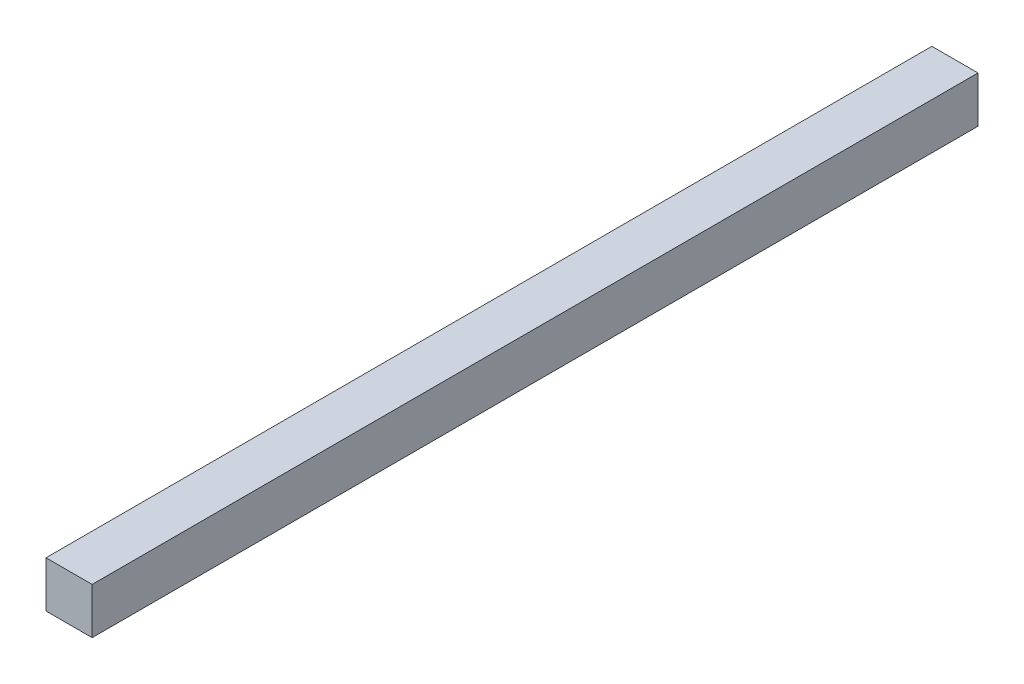
ISO-10303-21;
HEADER;
FILE_DESCRIPTION(('STEP AP214'),'2;1');
FILE_NAME('part.step','',(''),(''),'','','');
FILE_SCHEMA(('AUTOMOTIVE_DESIGN { 1 0 10303 214 1 1 1 1 }'));
ENDSEC;
DATA;
#1=APPLICATION_CONTEXT('core data for automotive mechanical design processes');
#2=APPLICATION_PROTOCOL_DEFINITION('international standard','automotive_design',2000,#1);
#3=PRODUCT_CONTEXT('',#1,'mechanical');
#4=PRODUCT('Part','Part','',(#3));
#5=PRODUCT_RELATED_PRODUCT_CATEGORY('part','',(#4));
#6=PRODUCT_DEFINITION_FORMATION('','',#4);
#7=PRODUCT_DEFINITION_CONTEXT('part definition',#1,'design');
#8=PRODUCT_DEFINITION('design','',#6,#7);
#9=PRODUCT_DEFINITION_SHAPE('','',#8);
#10=(LENGTH_UNIT() NAMED_UNIT(*) SI_UNIT(.MILLI.,.METRE.));
#11=(NAMED_UNIT(*) PLANE_ANGLE_UNIT() SI_UNIT($,.RADIAN.));
#12=(NAMED_UNIT(*) SI_UNIT($,.STERADIAN.) SOLID_ANGLE_UNIT());
#13=UNCERTAINTY_MEASURE_WITH_UNIT(LENGTH_MEASURE(1.E-05),#10,'distance_accuracy_value','');
#14=(GEOMETRIC_REPRESENTATION_CONTEXT(3) GLOBAL_UNCERTAINTY_ASSIGNED_CONTEXT((#13)) GLOBAL_UNIT_ASSIGNED_CONTEXT((#10,
#11,#12)) REPRESENTATION_CONTEXT('',''));
#15=CARTESIAN_POINT('',(0.,0.,0.));
#16=DIRECTION('',(0.,0.,1.));
#17=DIRECTION('',(1.,0.,0.));
#18=AXIS2_PLACEMENT_3D('',#15,#16,#17);
#19=CARTESIAN_POINT('',(0.,0.,96.));
#20=DIRECTION('',(1.,0.,0.));
#21=DIRECTION('',(0.,0.,-1.));
#22=AXIS2_PLACEMENT_3D('',#19,#20,#21);
#23=PLANE('',#22);
#24=DIRECTION('',(0.,-1.,0.));
#25=VECTOR('',#24,1.);
#26=CARTESIAN_POINT('',(0.,0.,0.));
#27=LINE('',#26,#25);
#28=CARTESIAN_POINT('',(0.,5.,0.));
#29=VERTEX_POINT('',#28);
#30=CARTESIAN_POINT('',(0.,0.,0.));
#31=VERTEX_POINT('',#30);
#32=EDGE_CURVE('E108',#29,#31,#27,.T.);
#33=ORIENTED_EDGE('',*,*,#32,.T.);
#34=DIRECTION('',(0.,0.,-1.));
#35=VECTOR('',#34,1.);
#36=CARTESIAN_POINT('',(0.,0.,96.));
#37=LINE('',#36,#35);
#38=CARTESIAN_POINT('',(0.,0.,96.));
#39=VERTEX_POINT('',#38);
#40=EDGE_CURVE('E11',#39,#31,#37,.T.);
#41=ORIENTED_EDGE('',*,*,#40,.F.);
#42=DIRECTION('',(0.,-1.,0.));
#43=VECTOR('',#42,1.);
#44=CARTESIAN_POINT('',(0.,0.,96.));
#45=LINE('',#44,#43);
#46=CARTESIAN_POINT('',(0.,5.,96.));
#47=VERTEX_POINT('',#46);
#48=EDGE_CURVE('E92',#47,#39,#45,.T.);
#49=ORIENTED_EDGE('',*,*,#48,.F.);
#50=DIRECTION('',(0.,0.,-1.));
#51=VECTOR('',#50,1.);
#52=CARTESIAN_POINT('',(0.,5.,96.));
#53=LINE('',#52,#51);
#54=EDGE_CURVE('E104',#47,#29,#53,.T.);
#55=ORIENTED_EDGE('',*,*,#54,.T.);
#56=EDGE_LOOP('',(#33,#41,#49,#55));
#57=FACE_BOUND('',#56,.T.);
#58=ADVANCED_FACE('F40',(#57),#23,.F.);
#59=CARTESIAN_POINT('',(0.,0.,96.));
#60=DIRECTION('',(0.,1.,0.));
#61=DIRECTION('',(0.,0.,1.));
#62=AXIS2_PLACEMENT_3D('',#59,#60,#61);
#63=PLANE('',#62);
#64=DIRECTION('',(1.,0.,0.));
#65=VECTOR('',#64,1.);
#66=CARTESIAN_POINT('',(0.,0.,0.));
#67=LINE('',#66,#65);
#68=CARTESIAN_POINT('',(5.,0.,0.));
#69=VERTEX_POINT('',#68);
#70=EDGE_CURVE('E97',#31,#69,#67,.T.);
#71=ORIENTED_EDGE('',*,*,#70,.T.);
#72=DIRECTION('',(0.,0.,-1.));
#73=VECTOR('',#72,1.);
#74=CARTESIAN_POINT('',(5.,0.,96.));
#75=LINE('',#74,#73);
#76=CARTESIAN_POINT('',(5.,0.,96.));
#77=VERTEX_POINT('',#76);
#78=EDGE_CURVE('E49',#77,#69,#75,.T.);
#79=ORIENTED_EDGE('',*,*,#78,.F.);
#80=DIRECTION('',(1.,0.,0.));
#81=VECTOR('',#80,1.);
#82=CARTESIAN_POINT('',(0.,0.,96.));
#83=LINE('',#82,#81);
#84=EDGE_CURVE('E87',#39,#77,#83,.T.);
#85=ORIENTED_EDGE('',*,*,#84,.F.);
#86=ORIENTED_EDGE('',*,*,#40,.T.);
#87=EDGE_LOOP('',(#71,#79,#85,#86));
#88=FACE_BOUND('',#87,.T.);
#89=ADVANCED_FACE('F96',(#88),#63,.F.);
#90=CARTESIAN_POINT('',(5.,0.,96.));
#91=DIRECTION('',(-1.,0.,0.));
#92=DIRECTION('',(0.,0.,1.));
#93=AXIS2_PLACEMENT_3D('',#90,#91,#92);
#94=PLANE('',#93);
#95=DIRECTION('',(0.,1.,0.));
#96=VECTOR('',#95,1.);
#97=CARTESIAN_POINT('',(5.,0.,0.));
#98=LINE('',#97,#96);
#99=CARTESIAN_POINT('',(5.,5.,0.));
#100=VERTEX_POINT('',#99);
#101=EDGE_CURVE('E74',#69,#100,#98,.T.);
#102=ORIENTED_EDGE('',*,*,#101,.T.);
#103=DIRECTION('',(0.,0.,-1.));
#104=VECTOR('',#103,1.);
#105=CARTESIAN_POINT('',(5.,5.,96.));
#106=LINE('',#105,#104);
#107=CARTESIAN_POINT('',(5.,5.,96.));
#108=VERTEX_POINT('',#107);
#109=EDGE_CURVE('E99',#108,#100,#106,.T.);
#110=ORIENTED_EDGE('',*,*,#109,.F.);
#111=DIRECTION('',(0.,1.,0.));
#112=VECTOR('',#111,1.);
#113=CARTESIAN_POINT('',(5.,0.,96.));
#114=LINE('',#113,#112);
#115=EDGE_CURVE('E90',#77,#108,#114,.T.);
#116=ORIENTED_EDGE('',*,*,#115,.F.);
#117=ORIENTED_EDGE('',*,*,#78,.T.);
#118=EDGE_LOOP('',(#102,#110,#116,#117));
#119=FACE_BOUND('',#118,.T.);
#120=ADVANCED_FACE('F100',(#119),#94,.F.);
#121=CARTESIAN_POINT('',(0.,5.,96.));
#122=DIRECTION('',(0.,-1.,0.));
#123=DIRECTION('',(1.,0.,0.));
#124=AXIS2_PLACEMENT_3D('',#121,#122,#123);
#125=PLANE('',#124);
#126=DIRECTION('',(-1.,0.,0.));
#127=VECTOR('',#126,1.);
#128=CARTESIAN_POINT('',(0.,5.,0.));
#129=LINE('',#128,#127);
#130=EDGE_CURVE('E80',#100,#29,#129,.T.);
#131=ORIENTED_EDGE('',*,*,#130,.T.);
#132=ORIENTED_EDGE('',*,*,#54,.F.);
#133=DIRECTION('',(-1.,0.,0.));
#134=VECTOR('',#133,1.);
#135=CARTESIAN_POINT('',(0.,5.,96.));
#136=LINE('',#135,#134);
#137=EDGE_CURVE('E57',#108,#47,#136,.T.);
#138=ORIENTED_EDGE('',*,*,#137,.F.);
#139=ORIENTED_EDGE('',*,*,#109,.T.);
#140=EDGE_LOOP('',(#131,#132,#138,#139));
#141=FACE_BOUND('',#140,.T.);
#142=ADVANCED_FACE('F121',(#141),#125,.F.);
#143=CARTESIAN_POINT('',(0.,0.,96.));
#144=DIRECTION('',(0.,0.,-1.));
#145=DIRECTION('',(-1.,0.,0.));
#146=AXIS2_PLACEMENT_3D('',#143,#144,#145);
#147=PLANE('',#146);
#148=ORIENTED_EDGE('',*,*,#48,.T.);
#149=ORIENTED_EDGE('',*,*,#84,.T.);
#150=ORIENTED_EDGE('',*,*,#115,.T.);
#151=ORIENTED_EDGE('',*,*,#137,.T.);
#152=EDGE_LOOP('',(#148,#149,#150,#151));
#153=FACE_BOUND('',#152,.T.);
#154=ADVANCED_FACE('F88',(#153),#147,.F.);
#155=CARTESIAN_POINT('',(0.,0.,0.));
#156=DIRECTION('',(0.,0.,-1.));
#157=DIRECTION('',(-1.,0.,0.));
#158=AXIS2_PLACEMENT_3D('',#155,#156,#157);
#159=PLANE('',#158);
#160=ORIENTED_EDGE('',*,*,#32,.F.);
#161=ORIENTED_EDGE('',*,*,#130,.F.);
#162=ORIENTED_EDGE('',*,*,#101,.F.);
#163=ORIENTED_EDGE('',*,*,#70,.F.);
#164=EDGE_LOOP('',(#160,#161,#162,#163));
#165=FACE_BOUND('',#164,.T.);
#166=ADVANCED_FACE('F124',(#165),#159,.T.);
#167=CLOSED_SHELL('',(#58,#89,#120,#142,#154,#166));
#168=MANIFOLD_SOLID_BREP('B2',#167);
#169=ADVANCED_BREP_SHAPE_REPRESENTATION('',(#18,#168),#14);
#170=SHAPE_DEFINITION_REPRESENTATION(#9,#169);
ENDSEC;
END-ISO-10303-21;
